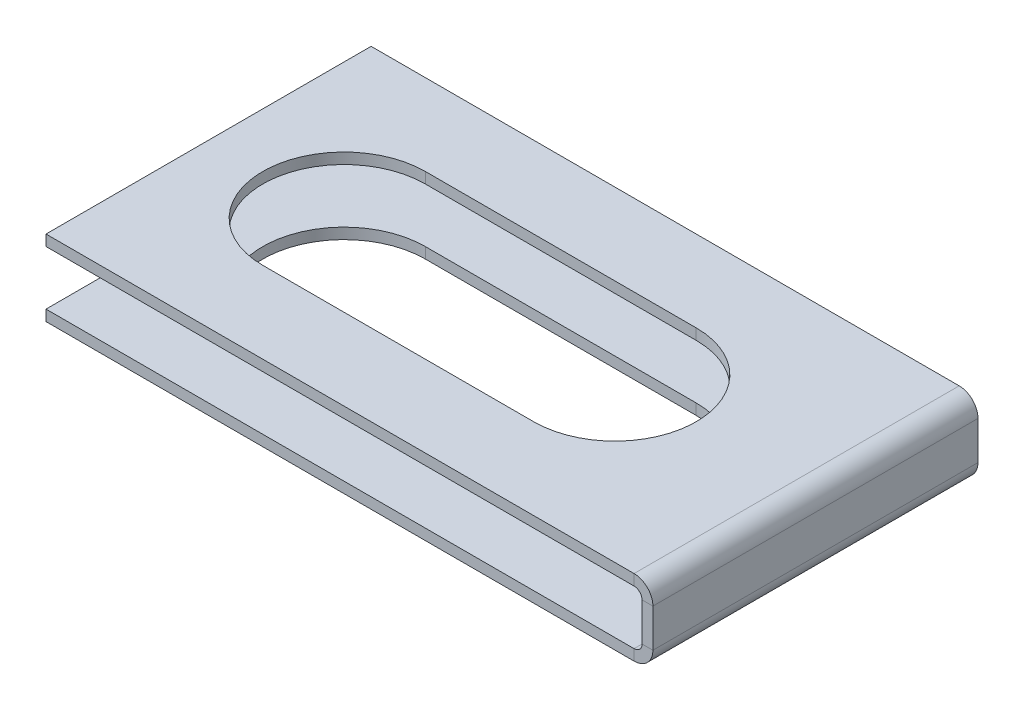
ISO-10303-21;
HEADER;
FILE_DESCRIPTION(('STEP AP214'),'2;1');
FILE_NAME('part.step','',(''),(''),'','','');
FILE_SCHEMA(('AUTOMOTIVE_DESIGN { 1 0 10303 214 1 1 1 1 }'));
ENDSEC;
DATA;
#1=APPLICATION_CONTEXT('core data for automotive mechanical design processes');
#2=APPLICATION_PROTOCOL_DEFINITION('international standard','automotive_design',2000,#1);
#3=PRODUCT_CONTEXT('',#1,'mechanical');
#4=PRODUCT('Part','Part','',(#3));
#5=PRODUCT_RELATED_PRODUCT_CATEGORY('part','',(#4));
#6=PRODUCT_DEFINITION_FORMATION('','',#4);
#7=PRODUCT_DEFINITION_CONTEXT('part definition',#1,'design');
#8=PRODUCT_DEFINITION('design','',#6,#7);
#9=PRODUCT_DEFINITION_SHAPE('','',#8);
#10=(LENGTH_UNIT() NAMED_UNIT(*) SI_UNIT(.MILLI.,.METRE.));
#11=(NAMED_UNIT(*) PLANE_ANGLE_UNIT() SI_UNIT($,.RADIAN.));
#12=(NAMED_UNIT(*) SI_UNIT($,.STERADIAN.) SOLID_ANGLE_UNIT());
#13=UNCERTAINTY_MEASURE_WITH_UNIT(LENGTH_MEASURE(1.E-05),#10,'distance_accuracy_value','');
#14=(GEOMETRIC_REPRESENTATION_CONTEXT(3) GLOBAL_UNCERTAINTY_ASSIGNED_CONTEXT((#13)) GLOBAL_UNIT_ASSIGNED_CONTEXT((#10,
#11,#12)) REPRESENTATION_CONTEXT('',''));
#15=CARTESIAN_POINT('',(0.,0.,0.));
#16=DIRECTION('',(0.,0.,1.));
#17=DIRECTION('',(1.,0.,0.));
#18=AXIS2_PLACEMENT_3D('',#15,#16,#17);
#19=CARTESIAN_POINT('',(28.5,-6.,15.));
#20=DIRECTION('',(0.,0.,-1.));
#21=DIRECTION('',(0.,1.,0.));
#22=AXIS2_PLACEMENT_3D('',#19,#20,#21);
#23=PLANE('',#22);
#24=DIRECTION('',(1.,0.,0.));
#25=VECTOR('',#24,1.);
#26=CARTESIAN_POINT('',(27.5,-5.2634,15.));
#27=LINE('',#26,#25);
#28=CARTESIAN_POINT('',(27.5,-5.2634,15.));
#29=VERTEX_POINT('',#28);
#30=CARTESIAN_POINT('',(28.5,-5.2634,15.));
#31=VERTEX_POINT('',#30);
#32=EDGE_CURVE('E272',#29,#31,#27,.T.);
#33=ORIENTED_EDGE('',*,*,#32,.T.);
#34=DIRECTION('',(0.,-1.,0.));
#35=VECTOR('',#34,1.);
#36=CARTESIAN_POINT('',(28.5,-6.,15.));
#37=LINE('',#36,#35);
#38=CARTESIAN_POINT('',(28.5,-1.73659999999999,15.));
#39=VERTEX_POINT('',#38);
#40=EDGE_CURVE('E300',#39,#31,#37,.T.);
#41=ORIENTED_EDGE('',*,*,#40,.F.);
#42=DIRECTION('',(1.,0.,0.));
#43=VECTOR('',#42,1.);
#44=CARTESIAN_POINT('',(27.5,-1.7366,15.));
#45=LINE('',#44,#43);
#46=CARTESIAN_POINT('',(27.5,-1.7366,15.));
#47=VERTEX_POINT('',#46);
#48=EDGE_CURVE('E291',#47,#39,#45,.T.);
#49=ORIENTED_EDGE('',*,*,#48,.F.);
#50=DIRECTION('',(0.,-1.,0.));
#51=VECTOR('',#50,1.);
#52=CARTESIAN_POINT('',(27.5,-6.,15.));
#53=LINE('',#52,#51);
#54=EDGE_CURVE('E299',#47,#29,#53,.T.);
#55=ORIENTED_EDGE('',*,*,#54,.T.);
#56=EDGE_LOOP('',(#33,#41,#49,#55));
#57=FACE_BOUND('',#56,.T.);
#58=ADVANCED_FACE('F39',(#57),#23,.F.);
#59=CARTESIAN_POINT('',(28.5,-0.999999999999997,-15.));
#60=DIRECTION('',(0.,0.,1.));
#61=DIRECTION('',(0.,-1.,0.));
#62=AXIS2_PLACEMENT_3D('',#59,#60,#61);
#63=PLANE('',#62);
#64=DIRECTION('',(1.,0.,0.));
#65=VECTOR('',#64,1.);
#66=CARTESIAN_POINT('',(27.5,-5.2634,-15.));
#67=LINE('',#66,#65);
#68=CARTESIAN_POINT('',(27.5,-5.2634,-15.));
#69=VERTEX_POINT('',#68);
#70=CARTESIAN_POINT('',(28.5,-5.2634,-15.));
#71=VERTEX_POINT('',#70);
#72=EDGE_CURVE('E283',#69,#71,#67,.T.);
#73=ORIENTED_EDGE('',*,*,#72,.F.);
#74=DIRECTION('',(0.,1.,0.));
#75=VECTOR('',#74,1.);
#76=CARTESIAN_POINT('',(27.5,-1.,-15.));
#77=LINE('',#76,#75);
#78=CARTESIAN_POINT('',(27.5,-1.7366,-15.));
#79=VERTEX_POINT('',#78);
#80=EDGE_CURVE('E303',#69,#79,#77,.T.);
#81=ORIENTED_EDGE('',*,*,#80,.T.);
#82=DIRECTION('',(1.,0.,0.));
#83=VECTOR('',#82,1.);
#84=CARTESIAN_POINT('',(27.5,-1.7366,-15.));
#85=LINE('',#84,#83);
#86=CARTESIAN_POINT('',(28.5,-1.73659999999999,-15.));
#87=VERTEX_POINT('',#86);
#88=EDGE_CURVE('E286',#79,#87,#85,.T.);
#89=ORIENTED_EDGE('',*,*,#88,.T.);
#90=DIRECTION('',(0.,1.,0.));
#91=VECTOR('',#90,1.);
#92=CARTESIAN_POINT('',(28.5,-0.999999999999997,-15.));
#93=LINE('',#92,#91);
#94=EDGE_CURVE('E302',#71,#87,#93,.T.);
#95=ORIENTED_EDGE('',*,*,#94,.F.);
#96=EDGE_LOOP('',(#73,#81,#89,#95));
#97=FACE_BOUND('',#96,.T.);
#98=ADVANCED_FACE('F378',(#97),#63,.F.);
#99=CARTESIAN_POINT('',(28.5,0.,0.));
#100=DIRECTION('',(-1.,0.,0.));
#101=DIRECTION('',(0.,-1.,0.));
#102=AXIS2_PLACEMENT_3D('',#99,#100,#101);
#103=PLANE('',#102);
#104=DIRECTION('',(0.,0.,1.));
#105=VECTOR('',#104,1.);
#106=CARTESIAN_POINT('',(28.5,-5.2634,15.));
#107=LINE('',#106,#105);
#108=EDGE_CURVE('E266',#31,#71,#107,.F.);
#109=ORIENTED_EDGE('',*,*,#108,.T.);
#110=ORIENTED_EDGE('',*,*,#94,.T.);
#111=DIRECTION('',(0.,0.,-1.));
#112=VECTOR('',#111,1.);
#113=CARTESIAN_POINT('',(28.5,-1.73659999999999,0.));
#114=LINE('',#113,#112);
#115=EDGE_CURVE('E294',#39,#87,#114,.T.);
#116=ORIENTED_EDGE('',*,*,#115,.F.);
#117=ORIENTED_EDGE('',*,*,#40,.T.);
#118=EDGE_LOOP('',(#109,#110,#116,#117));
#119=FACE_BOUND('',#118,.T.);
#120=ADVANCED_FACE('F384',(#119),#103,.F.);
#121=CARTESIAN_POINT('',(27.5,0.,0.));
#122=DIRECTION('',(-1.,0.,0.));
#123=DIRECTION('',(0.,-1.,0.));
#124=AXIS2_PLACEMENT_3D('',#121,#122,#123);
#125=PLANE('',#124);
#126=ORIENTED_EDGE('',*,*,#80,.F.);
#127=DIRECTION('',(0.,0.,1.));
#128=VECTOR('',#127,1.);
#129=CARTESIAN_POINT('',(27.5,-5.2634,15.));
#130=LINE('',#129,#128);
#131=EDGE_CURVE('E278',#29,#69,#130,.F.);
#132=ORIENTED_EDGE('',*,*,#131,.F.);
#133=ORIENTED_EDGE('',*,*,#54,.F.);
#134=DIRECTION('',(0.,0.,1.));
#135=VECTOR('',#134,1.);
#136=CARTESIAN_POINT('',(27.5,-1.7366,-15.));
#137=LINE('',#136,#135);
#138=EDGE_CURVE('E289',#79,#47,#137,.T.);
#139=ORIENTED_EDGE('',*,*,#138,.F.);
#140=EDGE_LOOP('',(#126,#132,#133,#139));
#141=FACE_BOUND('',#140,.T.);
#142=ADVANCED_FACE('F417',(#141),#125,.T.);
#143=CARTESIAN_POINT('',(-27.5,-1.,15.));
#144=DIRECTION('',(0.,0.,1.));
#145=DIRECTION('',(1.,0.,0.));
#146=AXIS2_PLACEMENT_3D('',#143,#144,#145);
#147=PLANE('',#146);
#148=DIRECTION('',(1.,0.,0.));
#149=VECTOR('',#148,1.);
#150=CARTESIAN_POINT('',(-27.5,-1.,15.));
#151=LINE('',#150,#149);
#152=CARTESIAN_POINT('',(-27.5,-1.,15.));
#153=VERTEX_POINT('',#152);
#154=CARTESIAN_POINT('',(26.7634,-1.,15.));
#155=VERTEX_POINT('',#154);
#156=EDGE_CURVE('E337',#153,#155,#151,.T.);
#157=ORIENTED_EDGE('',*,*,#156,.T.);
#158=DIRECTION('',(0.,1.,0.));
#159=VECTOR('',#158,1.);
#160=CARTESIAN_POINT('',(26.7634,-1.,15.));
#161=LINE('',#160,#159);
#162=CARTESIAN_POINT('',(26.7634,0.,15.));
#163=VERTEX_POINT('',#162);
#164=EDGE_CURVE('E315',#155,#163,#161,.T.);
#165=ORIENTED_EDGE('',*,*,#164,.T.);
#166=DIRECTION('',(1.,0.,0.));
#167=VECTOR('',#166,1.);
#168=CARTESIAN_POINT('',(-27.5,0.,15.));
#169=LINE('',#168,#167);
#170=CARTESIAN_POINT('',(-27.5,0.,15.));
#171=VERTEX_POINT('',#170);
#172=EDGE_CURVE('E334',#171,#163,#169,.T.);
#173=ORIENTED_EDGE('',*,*,#172,.F.);
#174=DIRECTION('',(0.,1.,0.));
#175=VECTOR('',#174,1.);
#176=CARTESIAN_POINT('',(-27.5,-1.,15.));
#177=LINE('',#176,#175);
#178=EDGE_CURVE('E347',#153,#171,#177,.T.);
#179=ORIENTED_EDGE('',*,*,#178,.F.);
#180=EDGE_LOOP('',(#157,#165,#173,#179));
#181=FACE_BOUND('',#180,.T.);
#182=ADVANCED_FACE('F410',(#181),#147,.T.);
#183=CARTESIAN_POINT('',(0.,-1.,0.));
#184=DIRECTION('',(0.,-1.,0.));
#185=DIRECTION('',(0.,0.,-1.));
#186=AXIS2_PLACEMENT_3D('',#183,#184,#185);
#187=PLANE('',#186);
#188=CARTESIAN_POINT('',(-15.,-1.,0.));
#189=DIRECTION('',(0.,-1.,0.));
#190=DIRECTION('',(0.,0.,-1.));
#191=AXIS2_PLACEMENT_3D('',#188,#189,#190);
#192=CIRCLE('',#191,7.5);
#193=CARTESIAN_POINT('',(-15.,-1.,7.5));
#194=VERTEX_POINT('',#193);
#195=CARTESIAN_POINT('',(-15.,-1.,-7.5));
#196=VERTEX_POINT('',#195);
#197=EDGE_CURVE('E233',#194,#196,#192,.T.);
#198=ORIENTED_EDGE('',*,*,#197,.F.);
#199=DIRECTION('',(-1.,0.,0.));
#200=VECTOR('',#199,1.);
#201=CARTESIAN_POINT('',(0.,-1.,7.5));
#202=LINE('',#201,#200);
#203=CARTESIAN_POINT('',(9.99999999999999,-1.,7.5));
#204=VERTEX_POINT('',#203);
#205=EDGE_CURVE('E221',#204,#194,#202,.T.);
#206=ORIENTED_EDGE('',*,*,#205,.F.);
#207=CARTESIAN_POINT('',(9.99999999999999,-1.,0.));
#208=DIRECTION('',(0.,-1.,0.));
#209=DIRECTION('',(0.,0.,-1.));
#210=AXIS2_PLACEMENT_3D('',#207,#208,#209);
#211=CIRCLE('',#210,7.5);
#212=CARTESIAN_POINT('',(9.99999999999999,-1.,-7.5));
#213=VERTEX_POINT('',#212);
#214=EDGE_CURVE('E229',#213,#204,#211,.T.);
#215=ORIENTED_EDGE('',*,*,#214,.F.);
#216=DIRECTION('',(1.,0.,0.));
#217=VECTOR('',#216,1.);
#218=CARTESIAN_POINT('',(0.,-1.,-7.5));
#219=LINE('',#218,#217);
#220=EDGE_CURVE('E231',#196,#213,#219,.T.);
#221=ORIENTED_EDGE('',*,*,#220,.F.);
#222=EDGE_LOOP('',(#198,#206,#215,#221));
#223=FACE_BOUND('',#222,.T.);
#224=DIRECTION('',(-1.,0.,0.));
#225=VECTOR('',#224,1.);
#226=CARTESIAN_POINT('',(-27.5,-1.,-15.));
#227=LINE('',#226,#225);
#228=CARTESIAN_POINT('',(26.7634,-1.,-15.));
#229=VERTEX_POINT('',#228);
#230=CARTESIAN_POINT('',(-27.5,-1.,-15.));
#231=VERTEX_POINT('',#230);
#232=EDGE_CURVE('E331',#229,#231,#227,.T.);
#233=ORIENTED_EDGE('',*,*,#232,.F.);
#234=DIRECTION('',(0.,0.,1.));
#235=VECTOR('',#234,1.);
#236=CARTESIAN_POINT('',(26.7634,-1.,15.));
#237=LINE('',#236,#235);
#238=EDGE_CURVE('E321',#155,#229,#237,.F.);
#239=ORIENTED_EDGE('',*,*,#238,.F.);
#240=ORIENTED_EDGE('',*,*,#156,.F.);
#241=DIRECTION('',(0.,0.,1.));
#242=VECTOR('',#241,1.);
#243=CARTESIAN_POINT('',(-27.5,-1.,15.));
#244=LINE('',#243,#242);
#245=EDGE_CURVE('E333',#231,#153,#244,.T.);
#246=ORIENTED_EDGE('',*,*,#245,.F.);
#247=EDGE_LOOP('',(#233,#239,#240,#246));
#248=FACE_BOUND('',#247,.T.);
#249=ADVANCED_FACE('F406',(#223,#248),#187,.T.);
#250=CARTESIAN_POINT('',(0.,0.,0.));
#251=DIRECTION('',(0.,-1.,0.));
#252=DIRECTION('',(0.,0.,-1.));
#253=AXIS2_PLACEMENT_3D('',#250,#251,#252);
#254=PLANE('',#253);
#255=DIRECTION('',(1.,0.,0.));
#256=VECTOR('',#255,1.);
#257=CARTESIAN_POINT('',(-15.,0.,7.5));
#258=LINE('',#257,#256);
#259=CARTESIAN_POINT('',(-15.,0.,7.5));
#260=VERTEX_POINT('',#259);
#261=CARTESIAN_POINT('',(9.99999999999999,0.,7.5));
#262=VERTEX_POINT('',#261);
#263=EDGE_CURVE('E214',#260,#262,#258,.T.);
#264=ORIENTED_EDGE('',*,*,#263,.F.);
#265=CARTESIAN_POINT('',(-15.,0.,0.));
#266=DIRECTION('',(0.,1.,0.));
#267=DIRECTION('',(0.,0.,1.));
#268=AXIS2_PLACEMENT_3D('',#265,#266,#267);
#269=CIRCLE('',#268,7.5);
#270=CARTESIAN_POINT('',(-15.,0.,-7.5));
#271=VERTEX_POINT('',#270);
#272=EDGE_CURVE('E62',#271,#260,#269,.T.);
#273=ORIENTED_EDGE('',*,*,#272,.F.);
#274=DIRECTION('',(-1.,0.,0.));
#275=VECTOR('',#274,1.);
#276=CARTESIAN_POINT('',(-15.,0.,-7.5));
#277=LINE('',#276,#275);
#278=CARTESIAN_POINT('',(9.99999999999999,0.,-7.5));
#279=VERTEX_POINT('',#278);
#280=EDGE_CURVE('E202',#279,#271,#277,.T.);
#281=ORIENTED_EDGE('',*,*,#280,.F.);
#282=CARTESIAN_POINT('',(9.99999999999999,0.,0.));
#283=DIRECTION('',(0.,1.,0.));
#284=DIRECTION('',(0.,0.,1.));
#285=AXIS2_PLACEMENT_3D('',#282,#283,#284);
#286=CIRCLE('',#285,7.5);
#287=EDGE_CURVE('E205',#262,#279,#286,.T.);
#288=ORIENTED_EDGE('',*,*,#287,.F.);
#289=EDGE_LOOP('',(#264,#273,#281,#288));
#290=FACE_BOUND('',#289,.T.);
#291=DIRECTION('',(0.,0.,1.));
#292=VECTOR('',#291,1.);
#293=CARTESIAN_POINT('',(26.7634,0.,15.));
#294=LINE('',#293,#292);
#295=CARTESIAN_POINT('',(26.7634,0.,-15.));
#296=VERTEX_POINT('',#295);
#297=EDGE_CURVE('E309',#163,#296,#294,.F.);
#298=ORIENTED_EDGE('',*,*,#297,.T.);
#299=DIRECTION('',(-1.,0.,0.));
#300=VECTOR('',#299,1.);
#301=CARTESIAN_POINT('',(-27.5,0.,-15.));
#302=LINE('',#301,#300);
#303=CARTESIAN_POINT('',(-27.5,0.,-15.));
#304=VERTEX_POINT('',#303);
#305=EDGE_CURVE('E329',#296,#304,#302,.T.);
#306=ORIENTED_EDGE('',*,*,#305,.T.);
#307=DIRECTION('',(0.,0.,1.));
#308=VECTOR('',#307,1.);
#309=CARTESIAN_POINT('',(-27.5,0.,15.));
#310=LINE('',#309,#308);
#311=EDGE_CURVE('E342',#304,#171,#310,.T.);
#312=ORIENTED_EDGE('',*,*,#311,.T.);
#313=ORIENTED_EDGE('',*,*,#172,.T.);
#314=EDGE_LOOP('',(#298,#306,#312,#313));
#315=FACE_BOUND('',#314,.T.);
#316=ADVANCED_FACE('F409',(#290,#315),#254,.F.);
#317=CARTESIAN_POINT('',(-27.5,-1.,15.));
#318=DIRECTION('',(-1.,0.,0.));
#319=DIRECTION('',(0.,0.,1.));
#320=AXIS2_PLACEMENT_3D('',#317,#318,#319);
#321=PLANE('',#320);
#322=ORIENTED_EDGE('',*,*,#311,.F.);
#323=DIRECTION('',(0.,1.,0.));
#324=VECTOR('',#323,1.);
#325=CARTESIAN_POINT('',(-27.5,-1.,-15.));
#326=LINE('',#325,#324);
#327=EDGE_CURVE('E340',#231,#304,#326,.T.);
#328=ORIENTED_EDGE('',*,*,#327,.F.);
#329=ORIENTED_EDGE('',*,*,#245,.T.);
#330=ORIENTED_EDGE('',*,*,#178,.T.);
#331=EDGE_LOOP('',(#322,#328,#329,#330));
#332=FACE_BOUND('',#331,.T.);
#333=ADVANCED_FACE('F414',(#332),#321,.T.);
#334=CARTESIAN_POINT('',(-27.5,-1.,-15.));
#335=DIRECTION('',(0.,0.,-1.));
#336=DIRECTION('',(-1.,0.,0.));
#337=AXIS2_PLACEMENT_3D('',#334,#335,#336);
#338=PLANE('',#337);
#339=DIRECTION('',(0.,1.,0.));
#340=VECTOR('',#339,1.);
#341=CARTESIAN_POINT('',(26.7634,-1.,-15.));
#342=LINE('',#341,#340);
#343=EDGE_CURVE('E326',#229,#296,#342,.T.);
#344=ORIENTED_EDGE('',*,*,#343,.F.);
#345=ORIENTED_EDGE('',*,*,#232,.T.);
#346=ORIENTED_EDGE('',*,*,#327,.T.);
#347=ORIENTED_EDGE('',*,*,#305,.F.);
#348=EDGE_LOOP('',(#344,#345,#346,#347));
#349=FACE_BOUND('',#348,.T.);
#350=ADVANCED_FACE('F41',(#349),#338,.T.);
#351=CARTESIAN_POINT('',(26.7634,-1.7366,-15.));
#352=DIRECTION('',(0.,0.,-1.));
#353=DIRECTION('',(-1.,0.,0.));
#354=AXIS2_PLACEMENT_3D('',#351,#352,#353);
#355=PLANE('',#354);
#356=ORIENTED_EDGE('',*,*,#88,.F.);
#357=CARTESIAN_POINT('',(26.7634,-1.7366,-15.));
#358=DIRECTION('',(0.,0.,1.));
#359=DIRECTION('',(1.,0.,0.));
#360=AXIS2_PLACEMENT_3D('',#357,#358,#359);
#361=CIRCLE('',#360,0.7366);
#362=EDGE_CURVE('E318',#229,#79,#361,.F.);
#363=ORIENTED_EDGE('',*,*,#362,.F.);
#364=ORIENTED_EDGE('',*,*,#343,.T.);
#365=CARTESIAN_POINT('',(26.7634,-1.7366,-15.));
#366=DIRECTION('',(0.,0.,1.));
#367=DIRECTION('',(1.,0.,0.));
#368=AXIS2_PLACEMENT_3D('',#365,#366,#367);
#369=CIRCLE('',#368,1.7366);
#370=EDGE_CURVE('E311',#296,#87,#369,.F.);
#371=ORIENTED_EDGE('',*,*,#370,.T.);
#372=EDGE_LOOP('',(#356,#363,#364,#371));
#373=FACE_BOUND('',#372,.T.);
#374=ADVANCED_FACE('F399',(#373),#355,.T.);
#375=CARTESIAN_POINT('',(26.7634,-1.7366,15.));
#376=DIRECTION('',(0.,0.,-1.));
#377=DIRECTION('',(-1.,0.,0.));
#378=AXIS2_PLACEMENT_3D('',#375,#376,#377);
#379=PLANE('',#378);
#380=CARTESIAN_POINT('',(26.7634,-1.7366,15.));
#381=DIRECTION('',(0.,0.,1.));
#382=DIRECTION('',(1.,0.,0.));
#383=AXIS2_PLACEMENT_3D('',#380,#381,#382);
#384=CIRCLE('',#383,0.7366);
#385=EDGE_CURVE('E305',#47,#155,#384,.T.);
#386=ORIENTED_EDGE('',*,*,#385,.F.);
#387=ORIENTED_EDGE('',*,*,#48,.T.);
#388=CARTESIAN_POINT('',(26.7634,-1.7366,15.));
#389=DIRECTION('',(0.,0.,1.));
#390=DIRECTION('',(1.,0.,0.));
#391=AXIS2_PLACEMENT_3D('',#388,#389,#390);
#392=CIRCLE('',#391,1.7366);
#393=EDGE_CURVE('E312',#39,#163,#392,.T.);
#394=ORIENTED_EDGE('',*,*,#393,.T.);
#395=ORIENTED_EDGE('',*,*,#164,.F.);
#396=EDGE_LOOP('',(#386,#387,#394,#395));
#397=FACE_BOUND('',#396,.T.);
#398=ADVANCED_FACE('F393',(#397),#379,.F.);
#399=CARTESIAN_POINT('',(26.7634,-1.7366,15.));
#400=DIRECTION('',(0.,0.,1.));
#401=DIRECTION('',(1.,0.,0.));
#402=AXIS2_PLACEMENT_3D('',#399,#400,#401);
#403=CYLINDRICAL_SURFACE('',#402,1.7366);
#404=ORIENTED_EDGE('',*,*,#297,.F.);
#405=ORIENTED_EDGE('',*,*,#393,.F.);
#406=ORIENTED_EDGE('',*,*,#115,.T.);
#407=ORIENTED_EDGE('',*,*,#370,.F.);
#408=EDGE_LOOP('',(#404,#405,#406,#407));
#409=FACE_BOUND('',#408,.T.);
#410=ADVANCED_FACE('F389',(#409),#403,.T.);
#411=CARTESIAN_POINT('',(26.7634,-1.7366,15.));
#412=DIRECTION('',(0.,0.,1.));
#413=DIRECTION('',(1.,0.,0.));
#414=AXIS2_PLACEMENT_3D('',#411,#412,#413);
#415=CYLINDRICAL_SURFACE('',#414,0.7366);
#416=ORIENTED_EDGE('',*,*,#238,.T.);
#417=ORIENTED_EDGE('',*,*,#362,.T.);
#418=ORIENTED_EDGE('',*,*,#138,.T.);
#419=ORIENTED_EDGE('',*,*,#385,.T.);
#420=EDGE_LOOP('',(#416,#417,#418,#419));
#421=FACE_BOUND('',#420,.T.);
#422=ADVANCED_FACE('F392',(#421),#415,.F.);
#423=CARTESIAN_POINT('',(26.7634,-5.26340000000001,-15.));
#424=DIRECTION('',(0.,0.,-1.));
#425=DIRECTION('',(-1.,0.,0.));
#426=AXIS2_PLACEMENT_3D('',#423,#424,#425);
#427=PLANE('',#426);
#428=DIRECTION('',(0.,-1.,0.));
#429=VECTOR('',#428,1.);
#430=CARTESIAN_POINT('',(26.7634,-6.00000000000001,-15.));
#431=LINE('',#430,#429);
#432=CARTESIAN_POINT('',(26.7634,-6.00000000000001,-15.));
#433=VERTEX_POINT('',#432);
#434=CARTESIAN_POINT('',(26.7634,-7.00000000000001,-15.));
#435=VERTEX_POINT('',#434);
#436=EDGE_CURVE('E235',#433,#435,#431,.T.);
#437=ORIENTED_EDGE('',*,*,#436,.F.);
#438=CARTESIAN_POINT('',(26.7634,-5.26340000000001,-15.));
#439=DIRECTION('',(0.,0.,1.));
#440=DIRECTION('',(1.,0.,0.));
#441=AXIS2_PLACEMENT_3D('',#438,#439,#440);
#442=CIRCLE('',#441,0.7366);
#443=EDGE_CURVE('E275',#69,#433,#442,.F.);
#444=ORIENTED_EDGE('',*,*,#443,.F.);
#445=ORIENTED_EDGE('',*,*,#72,.T.);
#446=CARTESIAN_POINT('',(26.7634,-5.26340000000001,-15.));
#447=DIRECTION('',(0.,0.,1.));
#448=DIRECTION('',(1.,0.,0.));
#449=AXIS2_PLACEMENT_3D('',#446,#447,#448);
#450=CIRCLE('',#449,1.7366);
#451=EDGE_CURVE('E268',#71,#435,#450,.F.);
#452=ORIENTED_EDGE('',*,*,#451,.T.);
#453=EDGE_LOOP('',(#437,#444,#445,#452));
#454=FACE_BOUND('',#453,.T.);
#455=ADVANCED_FACE('F397',(#454),#427,.T.);
#456=CARTESIAN_POINT('',(26.7634,-5.26340000000001,15.));
#457=DIRECTION('',(0.,0.,-1.));
#458=DIRECTION('',(-1.,0.,0.));
#459=AXIS2_PLACEMENT_3D('',#456,#457,#458);
#460=PLANE('',#459);
#461=CARTESIAN_POINT('',(26.7634,-5.26340000000001,15.));
#462=DIRECTION('',(0.,0.,1.));
#463=DIRECTION('',(1.,0.,0.));
#464=AXIS2_PLACEMENT_3D('',#461,#462,#463);
#465=CIRCLE('',#464,0.7366);
#466=CARTESIAN_POINT('',(26.7634,-6.00000000000001,15.));
#467=VERTEX_POINT('',#466);
#468=EDGE_CURVE('E265',#467,#29,#465,.T.);
#469=ORIENTED_EDGE('',*,*,#468,.F.);
#470=DIRECTION('',(0.,-1.,0.));
#471=VECTOR('',#470,1.);
#472=CARTESIAN_POINT('',(26.7634,-6.00000000000001,15.));
#473=LINE('',#472,#471);
#474=CARTESIAN_POINT('',(26.7634,-7.00000000000001,15.));
#475=VERTEX_POINT('',#474);
#476=EDGE_CURVE('E238',#467,#475,#473,.T.);
#477=ORIENTED_EDGE('',*,*,#476,.T.);
#478=CARTESIAN_POINT('',(26.7634,-5.26340000000001,15.));
#479=DIRECTION('',(0.,0.,1.));
#480=DIRECTION('',(1.,0.,0.));
#481=AXIS2_PLACEMENT_3D('',#478,#479,#480);
#482=CIRCLE('',#481,1.7366);
#483=EDGE_CURVE('E269',#475,#31,#482,.T.);
#484=ORIENTED_EDGE('',*,*,#483,.T.);
#485=ORIENTED_EDGE('',*,*,#32,.F.);
#486=EDGE_LOOP('',(#469,#477,#484,#485));
#487=FACE_BOUND('',#486,.T.);
#488=ADVANCED_FACE('F446',(#487),#460,.F.);
#489=CARTESIAN_POINT('',(26.7634,-5.26340000000001,15.));
#490=DIRECTION('',(0.,0.,1.));
#491=DIRECTION('',(0.,-1.,0.));
#492=AXIS2_PLACEMENT_3D('',#489,#490,#491);
#493=CYLINDRICAL_SURFACE('',#492,1.7366);
#494=ORIENTED_EDGE('',*,*,#108,.F.);
#495=ORIENTED_EDGE('',*,*,#483,.F.);
#496=DIRECTION('',(0.,0.,-1.));
#497=VECTOR('',#496,1.);
#498=CARTESIAN_POINT('',(26.7634,-7.00000000000001,0.));
#499=LINE('',#498,#497);
#500=EDGE_CURVE('E241',#475,#435,#499,.T.);
#501=ORIENTED_EDGE('',*,*,#500,.T.);
#502=ORIENTED_EDGE('',*,*,#451,.F.);
#503=EDGE_LOOP('',(#494,#495,#501,#502));
#504=FACE_BOUND('',#503,.T.);
#505=ADVANCED_FACE('F468',(#504),#493,.T.);
#506=CARTESIAN_POINT('',(26.7634,-5.26340000000001,15.));
#507=DIRECTION('',(0.,0.,1.));
#508=DIRECTION('',(0.,-1.,0.));
#509=AXIS2_PLACEMENT_3D('',#506,#507,#508);
#510=CYLINDRICAL_SURFACE('',#509,0.7366);
#511=ORIENTED_EDGE('',*,*,#131,.T.);
#512=ORIENTED_EDGE('',*,*,#443,.T.);
#513=DIRECTION('',(0.,0.,1.));
#514=VECTOR('',#513,1.);
#515=CARTESIAN_POINT('',(26.7634,-6.00000000000001,-15.));
#516=LINE('',#515,#514);
#517=EDGE_CURVE('E236',#433,#467,#516,.T.);
#518=ORIENTED_EDGE('',*,*,#517,.T.);
#519=ORIENTED_EDGE('',*,*,#468,.T.);
#520=EDGE_LOOP('',(#511,#512,#518,#519));
#521=FACE_BOUND('',#520,.T.);
#522=ADVANCED_FACE('F449',(#521),#510,.F.);
#523=CARTESIAN_POINT('',(-27.5,-7.00000000000038,15.));
#524=DIRECTION('',(0.,0.,-1.));
#525=DIRECTION('',(-1.,0.,0.));
#526=AXIS2_PLACEMENT_3D('',#523,#524,#525);
#527=PLANE('',#526);
#528=ORIENTED_EDGE('',*,*,#476,.F.);
#529=DIRECTION('',(-1.,0.,0.));
#530=VECTOR('',#529,1.);
#531=CARTESIAN_POINT('',(-27.5,-6.00000000000038,15.));
#532=LINE('',#531,#530);
#533=CARTESIAN_POINT('',(-27.5,-6.00000000000038,15.));
#534=VERTEX_POINT('',#533);
#535=EDGE_CURVE('E245',#467,#534,#532,.T.);
#536=ORIENTED_EDGE('',*,*,#535,.T.);
#537=DIRECTION('',(0.,1.,0.));
#538=VECTOR('',#537,1.);
#539=CARTESIAN_POINT('',(-27.5,-7.00000000000038,15.));
#540=LINE('',#539,#538);
#541=CARTESIAN_POINT('',(-27.5,-7.00000000000038,15.));
#542=VERTEX_POINT('',#541);
#543=EDGE_CURVE('E262',#542,#534,#540,.T.);
#544=ORIENTED_EDGE('',*,*,#543,.F.);
#545=DIRECTION('',(-1.,0.,0.));
#546=VECTOR('',#545,1.);
#547=CARTESIAN_POINT('',(-27.5,-7.00000000000038,15.));
#548=LINE('',#547,#546);
#549=EDGE_CURVE('E246',#475,#542,#548,.T.);
#550=ORIENTED_EDGE('',*,*,#549,.F.);
#551=EDGE_LOOP('',(#528,#536,#544,#550));
#552=FACE_BOUND('',#551,.T.);
#553=ADVANCED_FACE('F464',(#552),#527,.F.);
#554=CARTESIAN_POINT('',(27.5,-7.,-15.));
#555=DIRECTION('',(0.,0.,1.));
#556=DIRECTION('',(1.,0.,0.));
#557=AXIS2_PLACEMENT_3D('',#554,#555,#556);
#558=PLANE('',#557);
#559=ORIENTED_EDGE('',*,*,#436,.T.);
#560=DIRECTION('',(1.,0.,0.));
#561=VECTOR('',#560,1.);
#562=CARTESIAN_POINT('',(27.5,-7.,-15.));
#563=LINE('',#562,#561);
#564=CARTESIAN_POINT('',(-27.5,-7.00000000000038,-15.));
#565=VERTEX_POINT('',#564);
#566=EDGE_CURVE('E251',#565,#435,#563,.T.);
#567=ORIENTED_EDGE('',*,*,#566,.F.);
#568=DIRECTION('',(0.,1.,0.));
#569=VECTOR('',#568,1.);
#570=CARTESIAN_POINT('',(-27.5,-7.00000000000038,-15.));
#571=LINE('',#570,#569);
#572=CARTESIAN_POINT('',(-27.5,-6.00000000000038,-15.));
#573=VERTEX_POINT('',#572);
#574=EDGE_CURVE('E254',#565,#573,#571,.T.);
#575=ORIENTED_EDGE('',*,*,#574,.T.);
#576=DIRECTION('',(1.,0.,0.));
#577=VECTOR('',#576,1.);
#578=CARTESIAN_POINT('',(27.5,-6.,-15.));
#579=LINE('',#578,#577);
#580=EDGE_CURVE('E249',#573,#433,#579,.T.);
#581=ORIENTED_EDGE('',*,*,#580,.T.);
#582=EDGE_LOOP('',(#559,#567,#575,#581));
#583=FACE_BOUND('',#582,.T.);
#584=ADVANCED_FACE('F456',(#583),#558,.F.);
#585=CARTESIAN_POINT('',(0.,-7.00000000000019,0.));
#586=DIRECTION('',(0.,1.,0.));
#587=DIRECTION('',(-1.,0.,0.));
#588=AXIS2_PLACEMENT_3D('',#585,#586,#587);
#589=PLANE('',#588);
#590=CARTESIAN_POINT('',(24.,-7.00000000000041,0.));
#591=DIRECTION('',(0.,1.,0.));
#592=DIRECTION('',(-1.,0.,0.));
#593=AXIS2_PLACEMENT_3D('',#590,#591,#592);
#594=CIRCLE('',#593,1.7);
#595=CARTESIAN_POINT('',(22.3,-7.00000000000043,0.));
#596=VERTEX_POINT('',#595);
#597=EDGE_CURVE('E215',#596,#596,#594,.T.);
#598=ORIENTED_EDGE('',*,*,#597,.T.);
#599=EDGE_LOOP('',(#598));
#600=FACE_BOUND('',#599,.T.);
#601=DIRECTION('',(-1.,0.,0.));
#602=VECTOR('',#601,1.);
#603=CARTESIAN_POINT('',(-15.,-7.00000000000038,-7.5));
#604=LINE('',#603,#602);
#605=CARTESIAN_POINT('',(9.99999999999999,-7.00000000000038,-7.5));
#606=VERTEX_POINT('',#605);
#607=CARTESIAN_POINT('',(-15.,-7.00000000000038,-7.5));
#608=VERTEX_POINT('',#607);
#609=EDGE_CURVE('E201',#606,#608,#604,.T.);
#610=ORIENTED_EDGE('',*,*,#609,.T.);
#611=CARTESIAN_POINT('',(-15.,-7.00000000000038,0.));
#612=DIRECTION('',(0.,1.,0.));
#613=DIRECTION('',(0.,0.,1.));
#614=AXIS2_PLACEMENT_3D('',#611,#612,#613);
#615=CIRCLE('',#614,7.5);
#616=CARTESIAN_POINT('',(-15.,-7.00000000000038,7.5));
#617=VERTEX_POINT('',#616);
#618=EDGE_CURVE('E181',#608,#617,#615,.T.);
#619=ORIENTED_EDGE('',*,*,#618,.T.);
#620=DIRECTION('',(1.,0.,0.));
#621=VECTOR('',#620,1.);
#622=CARTESIAN_POINT('',(-15.,-7.00000000000038,7.5));
#623=LINE('',#622,#621);
#624=CARTESIAN_POINT('',(9.99999999999999,-7.00000000000012,7.5));
#625=VERTEX_POINT('',#624);
#626=EDGE_CURVE('E190',#617,#625,#623,.T.);
#627=ORIENTED_EDGE('',*,*,#626,.T.);
#628=CARTESIAN_POINT('',(9.99999999999999,-7.00000000000038,0.));
#629=DIRECTION('',(0.,1.,0.));
#630=DIRECTION('',(0.,0.,1.));
#631=AXIS2_PLACEMENT_3D('',#628,#629,#630);
#632=CIRCLE('',#631,7.5);
#633=EDGE_CURVE('E196',#625,#606,#632,.T.);
#634=ORIENTED_EDGE('',*,*,#633,.T.);
#635=EDGE_LOOP('',(#610,#619,#627,#634));
#636=FACE_BOUND('',#635,.T.);
#637=ORIENTED_EDGE('',*,*,#500,.F.);
#638=ORIENTED_EDGE('',*,*,#549,.T.);
#639=DIRECTION('',(0.,0.,-1.));
#640=VECTOR('',#639,1.);
#641=CARTESIAN_POINT('',(-27.5,-7.00000000000038,-15.));
#642=LINE('',#641,#640);
#643=EDGE_CURVE('E248',#542,#565,#642,.T.);
#644=ORIENTED_EDGE('',*,*,#643,.T.);
#645=ORIENTED_EDGE('',*,*,#566,.T.);
#646=EDGE_LOOP('',(#637,#638,#644,#645));
#647=FACE_BOUND('',#646,.T.);
#648=ADVANCED_FACE('F198',(#600,#636,#647),#589,.F.);
#649=CARTESIAN_POINT('',(0.,-6.00000000000019,0.));
#650=DIRECTION('',(0.,1.,0.));
#651=DIRECTION('',(-1.,0.,0.));
#652=AXIS2_PLACEMENT_3D('',#649,#650,#651);
#653=PLANE('',#652);
#654=CARTESIAN_POINT('',(24.,-6.00000000000002,0.));
#655=DIRECTION('',(0.,1.,0.));
#656=DIRECTION('',(-1.,0.,0.));
#657=AXIS2_PLACEMENT_3D('',#654,#655,#656);
#658=CIRCLE('',#657,1.7);
#659=CARTESIAN_POINT('',(22.3,-6.00000000000004,0.));
#660=VERTEX_POINT('',#659);
#661=EDGE_CURVE('E208',#660,#660,#658,.T.);
#662=ORIENTED_EDGE('',*,*,#661,.F.);
#663=EDGE_LOOP('',(#662));
#664=FACE_BOUND('',#663,.T.);
#665=CARTESIAN_POINT('',(-15.,-6.0000000000003,0.));
#666=DIRECTION('',(0.,1.,0.));
#667=DIRECTION('',(-1.,0.,0.));
#668=AXIS2_PLACEMENT_3D('',#665,#666,#667);
#669=CIRCLE('',#668,7.5);
#670=CARTESIAN_POINT('',(-15.,-6.00000000000021,-7.5));
#671=VERTEX_POINT('',#670);
#672=CARTESIAN_POINT('',(-15.,-6.0000000000003,7.5));
#673=VERTEX_POINT('',#672);
#674=EDGE_CURVE('E11',#671,#673,#669,.T.);
#675=ORIENTED_EDGE('',*,*,#674,.F.);
#676=DIRECTION('',(-1.,0.,0.));
#677=VECTOR('',#676,1.);
#678=CARTESIAN_POINT('',(0.,-6.00000000000019,-7.5));
#679=LINE('',#678,#677);
#680=CARTESIAN_POINT('',(9.99999999999999,-6.00000000000017,-7.5));
#681=VERTEX_POINT('',#680);
#682=EDGE_CURVE('E47',#681,#671,#679,.T.);
#683=ORIENTED_EDGE('',*,*,#682,.F.);
#684=CARTESIAN_POINT('',(9.99999999999999,-6.00000000000012,0.));
#685=DIRECTION('',(0.,1.,0.));
#686=DIRECTION('',(-1.,0.,0.));
#687=AXIS2_PLACEMENT_3D('',#684,#685,#686);
#688=CIRCLE('',#687,7.5);
#689=CARTESIAN_POINT('',(9.99999999999999,-6.00000000000021,7.5));
#690=VERTEX_POINT('',#689);
#691=EDGE_CURVE('E353',#690,#681,#688,.T.);
#692=ORIENTED_EDGE('',*,*,#691,.F.);
#693=DIRECTION('',(1.,0.,0.));
#694=VECTOR('',#693,1.);
#695=CARTESIAN_POINT('',(0.,-6.00000000000019,7.5));
#696=LINE('',#695,#694);
#697=EDGE_CURVE('E349',#673,#690,#696,.T.);
#698=ORIENTED_EDGE('',*,*,#697,.F.);
#699=EDGE_LOOP('',(#675,#683,#692,#698));
#700=FACE_BOUND('',#699,.T.);
#701=ORIENTED_EDGE('',*,*,#535,.F.);
#702=ORIENTED_EDGE('',*,*,#517,.F.);
#703=ORIENTED_EDGE('',*,*,#580,.F.);
#704=DIRECTION('',(0.,0.,-1.));
#705=VECTOR('',#704,1.);
#706=CARTESIAN_POINT('',(-27.5,-6.00000000000038,-15.));
#707=LINE('',#706,#705);
#708=EDGE_CURVE('E256',#534,#573,#707,.T.);
#709=ORIENTED_EDGE('',*,*,#708,.F.);
#710=EDGE_LOOP('',(#701,#702,#703,#709));
#711=FACE_BOUND('',#710,.T.);
#712=ADVANCED_FACE('F359',(#664,#700,#711),#653,.T.);
#713=CARTESIAN_POINT('',(-27.5,-7.00000000000038,-15.));
#714=DIRECTION('',(1.,0.,0.));
#715=DIRECTION('',(0.,1.,0.));
#716=AXIS2_PLACEMENT_3D('',#713,#714,#715);
#717=PLANE('',#716);
#718=ORIENTED_EDGE('',*,*,#708,.T.);
#719=ORIENTED_EDGE('',*,*,#574,.F.);
#720=ORIENTED_EDGE('',*,*,#643,.F.);
#721=ORIENTED_EDGE('',*,*,#543,.T.);
#722=EDGE_LOOP('',(#718,#719,#720,#721));
#723=FACE_BOUND('',#722,.T.);
#724=ADVANCED_FACE('F372',(#723),#717,.F.);
#725=CARTESIAN_POINT('',(-15.,-7.00000000000038,7.5));
#726=DIRECTION('',(0.,0.,1.));
#727=DIRECTION('',(1.,0.,0.));
#728=AXIS2_PLACEMENT_3D('',#725,#726,#727);
#729=PLANE('',#728);
#730=ORIENTED_EDGE('',*,*,#697,.T.);
#731=DIRECTION('',(0.,1.,0.));
#732=VECTOR('',#731,1.);
#733=CARTESIAN_POINT('',(9.99999999999999,-7.00000000000038,7.5));
#734=LINE('',#733,#732);
#735=EDGE_CURVE('E193',#625,#690,#734,.T.);
#736=ORIENTED_EDGE('',*,*,#735,.F.);
#737=ORIENTED_EDGE('',*,*,#626,.F.);
#738=DIRECTION('',(0.,1.,0.));
#739=VECTOR('',#738,1.);
#740=CARTESIAN_POINT('',(-15.,-7.00000000000038,7.5));
#741=LINE('',#740,#739);
#742=EDGE_CURVE('E176',#617,#673,#741,.T.);
#743=ORIENTED_EDGE('',*,*,#742,.T.);
#744=EDGE_LOOP('',(#730,#736,#737,#743));
#745=FACE_BOUND('',#744,.T.);
#746=ADVANCED_FACE('F191',(#745),#729,.F.);
#747=CARTESIAN_POINT('',(9.99999999999999,-7.00000000000038,0.));
#748=DIRECTION('',(0.,1.,0.));
#749=DIRECTION('',(0.,0.,1.));
#750=AXIS2_PLACEMENT_3D('',#747,#748,#749);
#751=CYLINDRICAL_SURFACE('',#750,7.5);
#752=ORIENTED_EDGE('',*,*,#691,.T.);
#753=DIRECTION('',(0.,1.,0.));
#754=VECTOR('',#753,1.);
#755=CARTESIAN_POINT('',(9.99999999999999,-7.00000000000038,-7.5));
#756=LINE('',#755,#754);
#757=EDGE_CURVE('E223',#606,#681,#756,.T.);
#758=ORIENTED_EDGE('',*,*,#757,.F.);
#759=ORIENTED_EDGE('',*,*,#633,.F.);
#760=ORIENTED_EDGE('',*,*,#735,.T.);
#761=EDGE_LOOP('',(#752,#758,#759,#760));
#762=FACE_BOUND('',#761,.T.);
#763=ADVANCED_FACE('F362',(#762),#751,.F.);
#764=CARTESIAN_POINT('',(-15.,-7.00000000000038,-7.5));
#765=DIRECTION('',(0.,0.,-1.));
#766=DIRECTION('',(-1.,0.,0.));
#767=AXIS2_PLACEMENT_3D('',#764,#765,#766);
#768=PLANE('',#767);
#769=ORIENTED_EDGE('',*,*,#682,.T.);
#770=DIRECTION('',(0.,1.,0.));
#771=VECTOR('',#770,1.);
#772=CARTESIAN_POINT('',(-15.,-7.00000000000038,-7.5));
#773=LINE('',#772,#771);
#774=EDGE_CURVE('E219',#608,#671,#773,.T.);
#775=ORIENTED_EDGE('',*,*,#774,.F.);
#776=ORIENTED_EDGE('',*,*,#609,.F.);
#777=ORIENTED_EDGE('',*,*,#757,.T.);
#778=EDGE_LOOP('',(#769,#775,#776,#777));
#779=FACE_BOUND('',#778,.T.);
#780=ADVANCED_FACE('F356',(#779),#768,.F.);
#781=CARTESIAN_POINT('',(-15.,-7.00000000000038,0.));
#782=DIRECTION('',(0.,1.,0.));
#783=DIRECTION('',(0.,0.,1.));
#784=AXIS2_PLACEMENT_3D('',#781,#782,#783);
#785=CYLINDRICAL_SURFACE('',#784,7.5);
#786=ORIENTED_EDGE('',*,*,#674,.T.);
#787=ORIENTED_EDGE('',*,*,#742,.F.);
#788=ORIENTED_EDGE('',*,*,#618,.F.);
#789=ORIENTED_EDGE('',*,*,#774,.T.);
#790=EDGE_LOOP('',(#786,#787,#788,#789));
#791=FACE_BOUND('',#790,.T.);
#792=ADVANCED_FACE('F178',(#791),#785,.F.);
#793=ORIENTED_EDGE('',*,*,#197,.T.);
#794=EDGE_CURVE('E222',#196,#271,#773,.T.);
#795=ORIENTED_EDGE('',*,*,#794,.T.);
#796=ORIENTED_EDGE('',*,*,#272,.T.);
#797=EDGE_CURVE('E186',#194,#260,#741,.T.);
#798=ORIENTED_EDGE('',*,*,#797,.F.);
#799=EDGE_LOOP('',(#793,#795,#796,#798));
#800=FACE_BOUND('',#799,.T.);
#801=ADVANCED_FACE('F504',(#800),#785,.F.);
#802=ORIENTED_EDGE('',*,*,#220,.T.);
#803=EDGE_CURVE('E226',#213,#279,#756,.T.);
#804=ORIENTED_EDGE('',*,*,#803,.T.);
#805=ORIENTED_EDGE('',*,*,#280,.T.);
#806=ORIENTED_EDGE('',*,*,#794,.F.);
#807=EDGE_LOOP('',(#802,#804,#805,#806));
#808=FACE_BOUND('',#807,.T.);
#809=ADVANCED_FACE('F371',(#808),#768,.F.);
#810=ORIENTED_EDGE('',*,*,#214,.T.);
#811=EDGE_CURVE('E54',#204,#262,#734,.T.);
#812=ORIENTED_EDGE('',*,*,#811,.T.);
#813=ORIENTED_EDGE('',*,*,#287,.T.);
#814=ORIENTED_EDGE('',*,*,#803,.F.);
#815=EDGE_LOOP('',(#810,#812,#813,#814));
#816=FACE_BOUND('',#815,.T.);
#817=ADVANCED_FACE('F365',(#816),#751,.F.);
#818=ORIENTED_EDGE('',*,*,#205,.T.);
#819=ORIENTED_EDGE('',*,*,#797,.T.);
#820=ORIENTED_EDGE('',*,*,#263,.T.);
#821=ORIENTED_EDGE('',*,*,#811,.F.);
#822=EDGE_LOOP('',(#818,#819,#820,#821));
#823=FACE_BOUND('',#822,.T.);
#824=ADVANCED_FACE('F374',(#823),#729,.F.);
#825=CARTESIAN_POINT('',(24.,-7.00000000000041,0.));
#826=DIRECTION('',(0.,1.,0.));
#827=DIRECTION('',(-1.,0.,0.));
#828=AXIS2_PLACEMENT_3D('',#825,#826,#827);
#829=CYLINDRICAL_SURFACE('',#828,1.7);
#830=ORIENTED_EDGE('',*,*,#597,.F.);
#831=EDGE_LOOP('',(#830));
#832=FACE_BOUND('',#831,.T.);
#833=ORIENTED_EDGE('',*,*,#661,.T.);
#834=EDGE_LOOP('',(#833));
#835=FACE_BOUND('',#834,.T.);
#836=ADVANCED_FACE('F522',(#832,#835),#829,.F.);
#837=CLOSED_SHELL('',(#58,#98,#120,#142,#182,#249,#316,#333,#350,#374,#398,#410,#422,#455,#488,
#505,#522,#553,#584,#648,#712,#724,#746,#763,#780,#792,#801,#809,#817,#824,#836));
#838=MANIFOLD_SOLID_BREP('B2',#837);
#839=ADVANCED_BREP_SHAPE_REPRESENTATION('',(#18,#838),#14);
#840=SHAPE_DEFINITION_REPRESENTATION(#9,#839);
ENDSEC;
END-ISO-10303-21;
